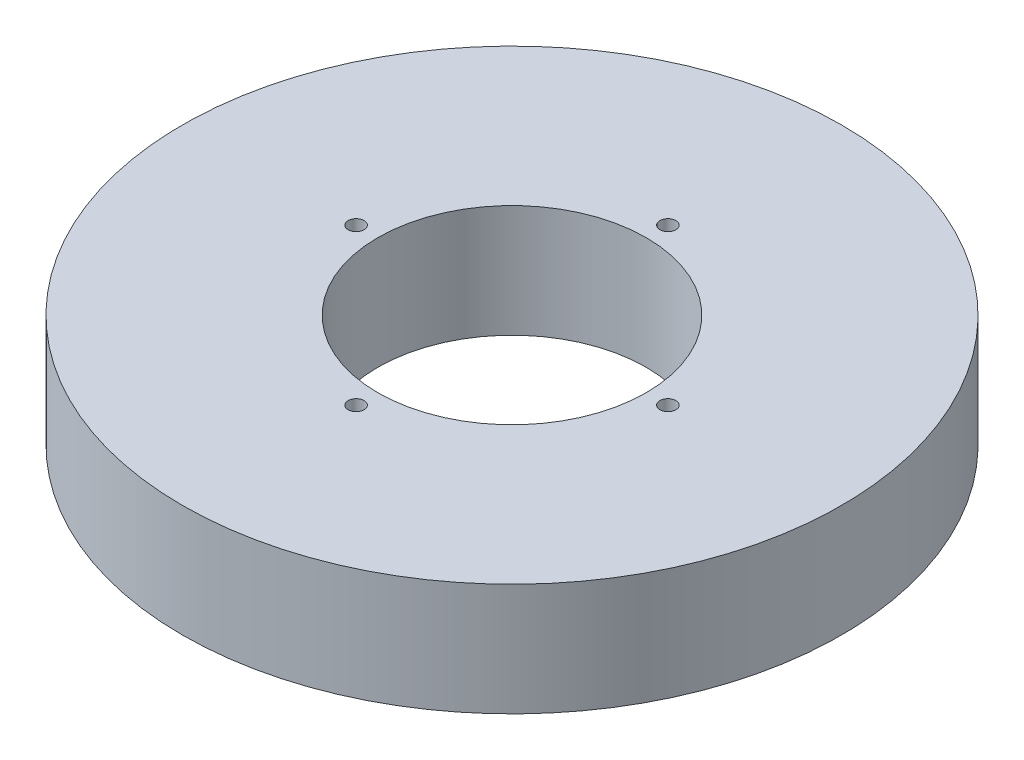
ISO-10303-21;
HEADER;
FILE_DESCRIPTION(('STEP AP214'),'2;1');
FILE_NAME('part.step','',(''),(''),'','','');
FILE_SCHEMA(('AUTOMOTIVE_DESIGN { 1 0 10303 214 1 1 1 1 }'));
ENDSEC;
DATA;
#1=APPLICATION_CONTEXT('core data for automotive mechanical design processes');
#2=APPLICATION_PROTOCOL_DEFINITION('international standard','automotive_design',2000,#1);
#3=PRODUCT_CONTEXT('',#1,'mechanical');
#4=PRODUCT('Part','Part','',(#3));
#5=PRODUCT_RELATED_PRODUCT_CATEGORY('part','',(#4));
#6=PRODUCT_DEFINITION_FORMATION('','',#4);
#7=PRODUCT_DEFINITION_CONTEXT('part definition',#1,'design');
#8=PRODUCT_DEFINITION('design','',#6,#7);
#9=PRODUCT_DEFINITION_SHAPE('','',#8);
#10=(LENGTH_UNIT() NAMED_UNIT(*) SI_UNIT(.MILLI.,.METRE.));
#11=(NAMED_UNIT(*) PLANE_ANGLE_UNIT() SI_UNIT($,.RADIAN.));
#12=(NAMED_UNIT(*) SI_UNIT($,.STERADIAN.) SOLID_ANGLE_UNIT());
#13=UNCERTAINTY_MEASURE_WITH_UNIT(LENGTH_MEASURE(1.E-05),#10,'distance_accuracy_value','');
#14=(GEOMETRIC_REPRESENTATION_CONTEXT(3) GLOBAL_UNCERTAINTY_ASSIGNED_CONTEXT((#13)) GLOBAL_UNIT_ASSIGNED_CONTEXT((#10,
#11,#12)) REPRESENTATION_CONTEXT('',''));
#15=CARTESIAN_POINT('',(0.,0.,0.));
#16=DIRECTION('',(0.,0.,1.));
#17=DIRECTION('',(1.,0.,0.));
#18=AXIS2_PLACEMENT_3D('',#15,#16,#17);
#19=CARTESIAN_POINT('',(0.,23.,0.));
#20=DIRECTION('',(0.,-1.,0.));
#21=DIRECTION('',(0.,0.,-1.));
#22=AXIS2_PLACEMENT_3D('',#19,#20,#21);
#23=CYLINDRICAL_SURFACE('',#22,67.5);
#24=CARTESIAN_POINT('',(0.,23.,0.));
#25=DIRECTION('',(0.,1.,0.));
#26=DIRECTION('',(0.,0.,1.));
#27=AXIS2_PLACEMENT_3D('',#24,#25,#26);
#28=CIRCLE('',#27,67.5);
#29=CARTESIAN_POINT('',(0.,23.,67.5));
#30=VERTEX_POINT('',#29);
#31=EDGE_CURVE('E10',#30,#30,#28,.T.);
#32=ORIENTED_EDGE('',*,*,#31,.F.);
#33=EDGE_LOOP('',(#32));
#34=FACE_BOUND('',#33,.T.);
#35=CARTESIAN_POINT('',(0.,0.,0.));
#36=DIRECTION('',(0.,1.,0.));
#37=DIRECTION('',(0.,0.,1.));
#38=AXIS2_PLACEMENT_3D('',#35,#36,#37);
#39=CIRCLE('',#38,67.5);
#40=CARTESIAN_POINT('',(0.,0.,67.5));
#41=VERTEX_POINT('',#40);
#42=EDGE_CURVE('E37',#41,#41,#39,.T.);
#43=ORIENTED_EDGE('',*,*,#42,.T.);
#44=EDGE_LOOP('',(#43));
#45=FACE_BOUND('',#44,.T.);
#46=ADVANCED_FACE('F40',(#34,#45),#23,.T.);
#47=CARTESIAN_POINT('',(0.,23.,0.));
#48=DIRECTION('',(0.,1.,0.));
#49=DIRECTION('',(0.,0.,1.));
#50=AXIS2_PLACEMENT_3D('',#47,#48,#49);
#51=PLANE('',#50);
#52=CARTESIAN_POINT('',(1.11487148035944E-13,23.,31.9311882883739));
#53=DIRECTION('',(0.,1.,0.));
#54=DIRECTION('',(1.,0.,0.));
#55=AXIS2_PLACEMENT_3D('',#52,#53,#54);
#56=CIRCLE('',#55,1.63695297468499);
#57=CARTESIAN_POINT('',(1.6369529746851,23.,31.9311882883739));
#58=VERTEX_POINT('',#57);
#59=EDGE_CURVE('E71',#58,#58,#56,.T.);
#60=ORIENTED_EDGE('',*,*,#59,.F.);
#61=EDGE_LOOP('',(#60));
#62=FACE_BOUND('',#61,.T.);
#63=CARTESIAN_POINT('',(31.9311882883739,23.,0.));
#64=DIRECTION('',(0.,1.,0.));
#65=DIRECTION('',(0.,0.,-1.));
#66=AXIS2_PLACEMENT_3D('',#63,#64,#65);
#67=CIRCLE('',#66,1.63695297468499);
#68=CARTESIAN_POINT('',(31.9311882883739,23.,-1.63695297468499));
#69=VERTEX_POINT('',#68);
#70=EDGE_CURVE('E70',#69,#69,#67,.T.);
#71=ORIENTED_EDGE('',*,*,#70,.F.);
#72=EDGE_LOOP('',(#71));
#73=FACE_BOUND('',#72,.T.);
#74=CARTESIAN_POINT('',(-3.34461444107832E-13,23.,-31.9311882883739));
#75=DIRECTION('',(0.,1.,0.));
#76=DIRECTION('',(-1.,0.,0.));
#77=AXIS2_PLACEMENT_3D('',#74,#75,#76);
#78=CIRCLE('',#77,1.63695297468499);
#79=CARTESIAN_POINT('',(-1.63695297468532,23.,-31.9311882883739));
#80=VERTEX_POINT('',#79);
#81=EDGE_CURVE('E61',#80,#80,#78,.T.);
#82=ORIENTED_EDGE('',*,*,#81,.F.);
#83=EDGE_LOOP('',(#82));
#84=FACE_BOUND('',#83,.T.);
#85=CARTESIAN_POINT('',(-31.9311882883739,23.,0.));
#86=DIRECTION('',(0.,1.,0.));
#87=DIRECTION('',(0.,0.,1.));
#88=AXIS2_PLACEMENT_3D('',#85,#86,#87);
#89=CIRCLE('',#88,1.63695297468499);
#90=CARTESIAN_POINT('',(-31.9311882883739,23.,1.63695297468499));
#91=VERTEX_POINT('',#90);
#92=EDGE_CURVE('E54',#91,#91,#89,.T.);
#93=ORIENTED_EDGE('',*,*,#92,.F.);
#94=EDGE_LOOP('',(#93));
#95=FACE_BOUND('',#94,.T.);
#96=CARTESIAN_POINT('',(0.,23.,0.));
#97=DIRECTION('',(0.,1.,0.));
#98=DIRECTION('',(0.,0.,1.));
#99=AXIS2_PLACEMENT_3D('',#96,#97,#98);
#100=CIRCLE('',#99,27.5);
#101=CARTESIAN_POINT('',(0.,23.,27.5));
#102=VERTEX_POINT('',#101);
#103=EDGE_CURVE('E50',#102,#102,#100,.T.);
#104=ORIENTED_EDGE('',*,*,#103,.F.);
#105=EDGE_LOOP('',(#104));
#106=FACE_BOUND('',#105,.T.);
#107=ORIENTED_EDGE('',*,*,#31,.T.);
#108=EDGE_LOOP('',(#107));
#109=FACE_BOUND('',#108,.T.);
#110=ADVANCED_FACE('F86',(#62,#73,#84,#95,#106,#109),#51,.T.);
#111=CARTESIAN_POINT('',(0.,0.,0.));
#112=DIRECTION('',(0.,1.,0.));
#113=DIRECTION('',(0.,0.,1.));
#114=AXIS2_PLACEMENT_3D('',#111,#112,#113);
#115=PLANE('',#114);
#116=CARTESIAN_POINT('',(0.,0.,0.));
#117=DIRECTION('',(0.,1.,0.));
#118=DIRECTION('',(0.,0.,1.));
#119=AXIS2_PLACEMENT_3D('',#116,#117,#118);
#120=CIRCLE('',#119,27.5);
#121=CARTESIAN_POINT('',(0.,0.,27.5));
#122=VERTEX_POINT('',#121);
#123=EDGE_CURVE('E47',#122,#122,#120,.T.);
#124=ORIENTED_EDGE('',*,*,#123,.T.);
#125=EDGE_LOOP('',(#124));
#126=FACE_BOUND('',#125,.T.);
#127=ORIENTED_EDGE('',*,*,#42,.F.);
#128=EDGE_LOOP('',(#127));
#129=FACE_BOUND('',#128,.T.);
#130=ADVANCED_FACE('F93',(#126,#129),#115,.F.);
#131=CARTESIAN_POINT('',(0.,23.,0.));
#132=DIRECTION('',(0.,-1.,0.));
#133=DIRECTION('',(0.,0.,-1.));
#134=AXIS2_PLACEMENT_3D('',#131,#132,#133);
#135=CYLINDRICAL_SURFACE('',#134,27.5);
#136=ORIENTED_EDGE('',*,*,#103,.T.);
#137=EDGE_LOOP('',(#136));
#138=FACE_BOUND('',#137,.T.);
#139=ORIENTED_EDGE('',*,*,#123,.F.);
#140=EDGE_LOOP('',(#139));
#141=FACE_BOUND('',#140,.T.);
#142=ADVANCED_FACE('F101',(#138,#141),#135,.F.);
#143=CARTESIAN_POINT('',(-31.9311882883739,0.761512668001504,0.));
#144=DIRECTION('',(0.,1.,0.));
#145=DIRECTION('',(0.,0.,1.));
#146=AXIS2_PLACEMENT_3D('',#143,#144,#145);
#147=CYLINDRICAL_SURFACE('',#146,1.63695297468499);
#148=CARTESIAN_POINT('',(-31.9311882883739,0.761512668001504,0.));
#149=DIRECTION('',(0.,1.,0.));
#150=DIRECTION('',(0.,0.,1.));
#151=AXIS2_PLACEMENT_3D('',#148,#149,#150);
#152=CIRCLE('',#151,1.63695297468499);
#153=CARTESIAN_POINT('',(-31.9311882883739,0.761512668001504,1.63695297468499));
#154=VERTEX_POINT('',#153);
#155=EDGE_CURVE('E55',#154,#154,#152,.T.);
#156=ORIENTED_EDGE('',*,*,#155,.F.);
#157=EDGE_LOOP('',(#156));
#158=FACE_BOUND('',#157,.T.);
#159=ORIENTED_EDGE('',*,*,#92,.T.);
#160=EDGE_LOOP('',(#159));
#161=FACE_BOUND('',#160,.T.);
#162=ADVANCED_FACE('F102',(#158,#161),#147,.F.);
#163=CARTESIAN_POINT('',(-31.9311882883739,0.761512668001504,0.));
#164=DIRECTION('',(0.,1.,0.));
#165=DIRECTION('',(0.,0.,1.));
#166=AXIS2_PLACEMENT_3D('',#163,#164,#165);
#167=PLANE('',#166);
#168=ORIENTED_EDGE('',*,*,#155,.T.);
#169=EDGE_LOOP('',(#168));
#170=FACE_BOUND('',#169,.T.);
#171=ADVANCED_FACE('F133',(#170),#167,.T.);
#172=CARTESIAN_POINT('',(-3.34461444107832E-13,0.761512668001504,-31.9311882883739));
#173=DIRECTION('',(0.,1.,0.));
#174=DIRECTION('',(0.,0.,1.));
#175=AXIS2_PLACEMENT_3D('',#172,#173,#174);
#176=CYLINDRICAL_SURFACE('',#175,1.63695297468499);
#177=CARTESIAN_POINT('',(-3.34461444107832E-13,0.761512668001504,-31.9311882883739));
#178=DIRECTION('',(0.,1.,0.));
#179=DIRECTION('',(-1.,0.,0.));
#180=AXIS2_PLACEMENT_3D('',#177,#178,#179);
#181=CIRCLE('',#180,1.63695297468499);
#182=CARTESIAN_POINT('',(-1.63695297468532,0.761512668001504,-31.9311882883739));
#183=VERTEX_POINT('',#182);
#184=EDGE_CURVE('E63',#183,#183,#181,.T.);
#185=ORIENTED_EDGE('',*,*,#184,.F.);
#186=EDGE_LOOP('',(#185));
#187=FACE_BOUND('',#186,.T.);
#188=ORIENTED_EDGE('',*,*,#81,.T.);
#189=EDGE_LOOP('',(#188));
#190=FACE_BOUND('',#189,.T.);
#191=ADVANCED_FACE('F142',(#187,#190),#176,.F.);
#192=CARTESIAN_POINT('',(-3.34461444107832E-13,0.761512668001504,-31.9311882883739));
#193=DIRECTION('',(0.,1.,0.));
#194=DIRECTION('',(-1.,0.,0.));
#195=AXIS2_PLACEMENT_3D('',#192,#193,#194);
#196=PLANE('',#195);
#197=ORIENTED_EDGE('',*,*,#184,.T.);
#198=EDGE_LOOP('',(#197));
#199=FACE_BOUND('',#198,.T.);
#200=ADVANCED_FACE('F156',(#199),#196,.T.);
#201=CARTESIAN_POINT('',(31.9311882883739,0.761512668001504,0.));
#202=DIRECTION('',(0.,1.,0.));
#203=DIRECTION('',(0.,0.,1.));
#204=AXIS2_PLACEMENT_3D('',#201,#202,#203);
#205=CYLINDRICAL_SURFACE('',#204,1.63695297468499);
#206=CARTESIAN_POINT('',(31.9311882883739,0.761512668001504,0.));
#207=DIRECTION('',(0.,1.,0.));
#208=DIRECTION('',(0.,0.,-1.));
#209=AXIS2_PLACEMENT_3D('',#206,#207,#208);
#210=CIRCLE('',#209,1.63695297468499);
#211=CARTESIAN_POINT('',(31.9311882883739,0.761512668001504,-1.63695297468499));
#212=VERTEX_POINT('',#211);
#213=EDGE_CURVE('E69',#212,#212,#210,.T.);
#214=ORIENTED_EDGE('',*,*,#213,.F.);
#215=EDGE_LOOP('',(#214));
#216=FACE_BOUND('',#215,.T.);
#217=ORIENTED_EDGE('',*,*,#70,.T.);
#218=EDGE_LOOP('',(#217));
#219=FACE_BOUND('',#218,.T.);
#220=ADVANCED_FACE('F164',(#216,#219),#205,.F.);
#221=CARTESIAN_POINT('',(31.9311882883739,0.761512668001504,0.));
#222=DIRECTION('',(0.,1.,0.));
#223=DIRECTION('',(0.,0.,-1.));
#224=AXIS2_PLACEMENT_3D('',#221,#222,#223);
#225=PLANE('',#224);
#226=ORIENTED_EDGE('',*,*,#213,.T.);
#227=EDGE_LOOP('',(#226));
#228=FACE_BOUND('',#227,.T.);
#229=ADVANCED_FACE('F83',(#228),#225,.T.);
#230=CARTESIAN_POINT('',(1.11487148035944E-13,0.761512668001504,31.9311882883739));
#231=DIRECTION('',(0.,1.,0.));
#232=DIRECTION('',(0.,0.,1.));
#233=AXIS2_PLACEMENT_3D('',#230,#231,#232);
#234=CYLINDRICAL_SURFACE('',#233,1.63695297468499);
#235=CARTESIAN_POINT('',(1.11487148035944E-13,0.761512668001504,31.9311882883739));
#236=DIRECTION('',(0.,1.,0.));
#237=DIRECTION('',(1.,0.,0.));
#238=AXIS2_PLACEMENT_3D('',#235,#236,#237);
#239=CIRCLE('',#238,1.63695297468499);
#240=CARTESIAN_POINT('',(1.6369529746851,0.761512668001504,31.9311882883739));
#241=VERTEX_POINT('',#240);
#242=EDGE_CURVE('E59',#241,#241,#239,.T.);
#243=ORIENTED_EDGE('',*,*,#242,.F.);
#244=EDGE_LOOP('',(#243));
#245=FACE_BOUND('',#244,.T.);
#246=ORIENTED_EDGE('',*,*,#59,.T.);
#247=EDGE_LOOP('',(#246));
#248=FACE_BOUND('',#247,.T.);
#249=ADVANCED_FACE('F81',(#245,#248),#234,.F.);
#250=CARTESIAN_POINT('',(1.11487148035944E-13,0.761512668001504,31.9311882883739));
#251=DIRECTION('',(0.,1.,0.));
#252=DIRECTION('',(1.,0.,0.));
#253=AXIS2_PLACEMENT_3D('',#250,#251,#252);
#254=PLANE('',#253);
#255=ORIENTED_EDGE('',*,*,#242,.T.);
#256=EDGE_LOOP('',(#255));
#257=FACE_BOUND('',#256,.T.);
#258=ADVANCED_FACE('F78',(#257),#254,.T.);
#259=CLOSED_SHELL('',(#46,#110,#130,#142,#162,#171,#191,#200,#220,#229,#249,#258));
#260=MANIFOLD_SOLID_BREP('B2',#259);
#261=ADVANCED_BREP_SHAPE_REPRESENTATION('',(#18,#260),#14);
#262=SHAPE_DEFINITION_REPRESENTATION(#9,#261);
ENDSEC;
END-ISO-10303-21;
